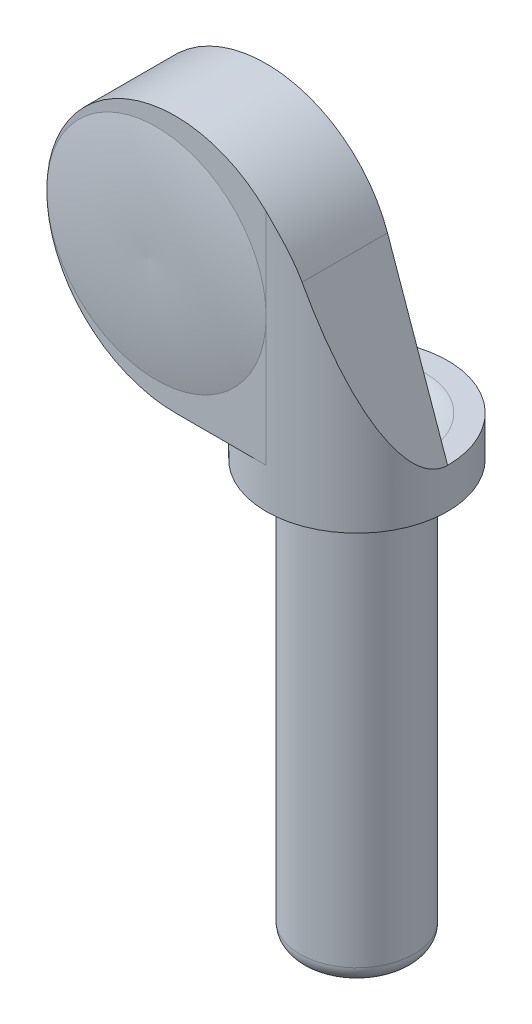
ISO-10303-21;
HEADER;
FILE_DESCRIPTION(('STEP AP214'),'2;1');
FILE_NAME('part.step','',(''),(''),'','','');
FILE_SCHEMA(('AUTOMOTIVE_DESIGN { 1 0 10303 214 1 1 1 1 }'));
ENDSEC;
DATA;
#1=APPLICATION_CONTEXT('core data for automotive mechanical design processes');
#2=APPLICATION_PROTOCOL_DEFINITION('international standard','automotive_design',2000,#1);
#3=PRODUCT_CONTEXT('',#1,'mechanical');
#4=PRODUCT('Part','Part','',(#3));
#5=PRODUCT_RELATED_PRODUCT_CATEGORY('part','',(#4));
#6=PRODUCT_DEFINITION_FORMATION('','',#4);
#7=PRODUCT_DEFINITION_CONTEXT('part definition',#1,'design');
#8=PRODUCT_DEFINITION('design','',#6,#7);
#9=PRODUCT_DEFINITION_SHAPE('','',#8);
#10=(LENGTH_UNIT() NAMED_UNIT(*) SI_UNIT(.MILLI.,.METRE.));
#11=(NAMED_UNIT(*) PLANE_ANGLE_UNIT() SI_UNIT($,.RADIAN.));
#12=(NAMED_UNIT(*) SI_UNIT($,.STERADIAN.) SOLID_ANGLE_UNIT());
#13=UNCERTAINTY_MEASURE_WITH_UNIT(LENGTH_MEASURE(1.E-05),#10,'distance_accuracy_value','');
#14=(GEOMETRIC_REPRESENTATION_CONTEXT(3) GLOBAL_UNCERTAINTY_ASSIGNED_CONTEXT((#13)) GLOBAL_UNIT_ASSIGNED_CONTEXT((#10,
#11,#12)) REPRESENTATION_CONTEXT('',''));
#15=CARTESIAN_POINT('',(0.,0.,0.));
#16=DIRECTION('',(0.,0.,1.));
#17=DIRECTION('',(1.,0.,0.));
#18=AXIS2_PLACEMENT_3D('',#15,#16,#17);
#19=CARTESIAN_POINT('',(-3.175,20.5,3.175));
#20=DIRECTION('',(0.,0.,1.));
#21=DIRECTION('',(1.,0.,0.));
#22=AXIS2_PLACEMENT_3D('',#19,#20,#21);
#23=PLANE('',#22);
#24=DIRECTION('',(0.,-1.,0.));
#25=VECTOR('',#24,1.);
#26=CARTESIAN_POINT('',(0.,25.,3.175));
#27=LINE('',#26,#25);
#28=CARTESIAN_POINT('',(0.,20.5000000000001,3.175));
#29=VERTEX_POINT('',#28);
#30=CARTESIAN_POINT('',(0.,16.,3.175));
#31=VERTEX_POINT('',#30);
#32=EDGE_CURVE('E163',#29,#31,#27,.T.);
#33=ORIENTED_EDGE('',*,*,#32,.F.);
#34=CARTESIAN_POINT('',(-3.8375,20.5,3.175));
#35=DIRECTION('',(0.,0.,-1.));
#36=DIRECTION('',(-1.,0.,0.));
#37=AXIS2_PLACEMENT_3D('',#34,#35,#36);
#38=CIRCLE('',#37,3.8375);
#39=CARTESIAN_POINT('',(-7.675,20.5,3.175));
#40=VERTEX_POINT('',#39);
#41=EDGE_CURVE('E127',#29,#40,#38,.T.);
#42=ORIENTED_EDGE('',*,*,#41,.T.);
#43=CARTESIAN_POINT('',(-3.175,20.5,3.175));
#44=DIRECTION('',(0.,0.,1.));
#45=DIRECTION('',(1.,0.,0.));
#46=AXIS2_PLACEMENT_3D('',#43,#44,#45);
#47=CIRCLE('',#46,4.5);
#48=CARTESIAN_POINT('',(-3.175,16.,3.175));
#49=VERTEX_POINT('',#48);
#50=EDGE_CURVE('E239',#40,#49,#47,.T.);
#51=ORIENTED_EDGE('',*,*,#50,.T.);
#52=DIRECTION('',(1.,0.,0.));
#53=VECTOR('',#52,1.);
#54=CARTESIAN_POINT('',(3.175,16.,3.175));
#55=LINE('',#54,#53);
#56=EDGE_CURVE('E226',#49,#31,#55,.T.);
#57=ORIENTED_EDGE('',*,*,#56,.T.);
#58=EDGE_LOOP('',(#33,#42,#51,#57));
#59=FACE_BOUND('',#58,.T.);
#60=ADVANCED_FACE('F39',(#59),#23,.T.);
#61=CARTESIAN_POINT('',(0.,23.6889457505577,3.175));
#62=VERTEX_POINT('',#61);
#63=EDGE_CURVE('E235',#62,#40,#47,.T.);
#64=ORIENTED_EDGE('',*,*,#63,.T.);
#65=EDGE_CURVE('E159',#40,#29,#38,.T.);
#66=ORIENTED_EDGE('',*,*,#65,.T.);
#67=EDGE_CURVE('E164',#62,#29,#27,.T.);
#68=ORIENTED_EDGE('',*,*,#67,.F.);
#69=EDGE_LOOP('',(#64,#66,#68));
#70=FACE_BOUND('',#69,.T.);
#71=ADVANCED_FACE('F206',(#70),#23,.T.);
#72=CARTESIAN_POINT('',(0.,16.,0.));
#73=DIRECTION('',(0.,-1.,0.));
#74=DIRECTION('',(0.,0.,-1.));
#75=AXIS2_PLACEMENT_3D('',#72,#73,#74);
#76=CYLINDRICAL_SURFACE('',#75,2.);
#77=CARTESIAN_POINT('',(0.,0.6,0.));
#78=DIRECTION('',(0.,1.,0.));
#79=DIRECTION('',(0.,0.,1.));
#80=AXIS2_PLACEMENT_3D('',#77,#78,#79);
#81=CIRCLE('',#80,2.);
#82=CARTESIAN_POINT('',(0.,0.6,2.));
#83=VERTEX_POINT('',#82);
#84=EDGE_CURVE('E132',#83,#83,#81,.T.);
#85=ORIENTED_EDGE('',*,*,#84,.T.);
#86=EDGE_LOOP('',(#85));
#87=FACE_BOUND('',#86,.T.);
#88=CARTESIAN_POINT('',(0.,14.6,0.));
#89=DIRECTION('',(0.,1.,0.));
#90=DIRECTION('',(0.,0.,1.));
#91=AXIS2_PLACEMENT_3D('',#88,#89,#90);
#92=CIRCLE('',#91,2.);
#93=CARTESIAN_POINT('',(0.,14.6,2.));
#94=VERTEX_POINT('',#93);
#95=EDGE_CURVE('E121',#94,#94,#92,.T.);
#96=ORIENTED_EDGE('',*,*,#95,.F.);
#97=EDGE_LOOP('',(#96));
#98=FACE_BOUND('',#97,.T.);
#99=ADVANCED_FACE('F208',(#87,#98),#76,.T.);
#100=CARTESIAN_POINT('',(0.,0.,0.));
#101=DIRECTION('',(0.,1.,0.));
#102=DIRECTION('',(0.,0.,1.));
#103=AXIS2_PLACEMENT_3D('',#100,#101,#102);
#104=PLANE('',#103);
#105=CARTESIAN_POINT('',(0.,0.,0.));
#106=DIRECTION('',(0.,1.,0.));
#107=DIRECTION('',(0.,0.,1.));
#108=AXIS2_PLACEMENT_3D('',#105,#106,#107);
#109=CIRCLE('',#108,1.4);
#110=CARTESIAN_POINT('',(1.4,0.,0.));
#111=VERTEX_POINT('',#110);
#112=CARTESIAN_POINT('',(-1.4,0.,0.));
#113=VERTEX_POINT('',#112);
#114=EDGE_CURVE('E122',#111,#113,#109,.F.);
#115=ORIENTED_EDGE('',*,*,#114,.T.);
#116=DIRECTION('',(-1.,0.,0.));
#117=VECTOR('',#116,1.);
#118=CARTESIAN_POINT('',(-1.4,0.,0.));
#119=LINE('',#118,#117);
#120=EDGE_CURVE('E105',#111,#113,#119,.T.);
#121=ORIENTED_EDGE('',*,*,#120,.F.);
#122=EDGE_LOOP('',(#115,#121));
#123=FACE_BOUND('',#122,.T.);
#124=ADVANCED_FACE('F125',(#123),#104,.F.);
#125=CARTESIAN_POINT('',(0.,0.6,0.));
#126=DIRECTION('',(0.,1.,0.));
#127=DIRECTION('',(0.,0.,1.));
#128=AXIS2_PLACEMENT_3D('',#125,#126,#127);
#129=TOROIDAL_SURFACE('',#128,1.4,0.6);
#130=EDGE_CURVE('E115',#113,#111,#109,.F.);
#131=ORIENTED_EDGE('',*,*,#130,.F.);
#132=ORIENTED_EDGE('',*,*,#114,.F.);
#133=EDGE_LOOP('',(#131,#132));
#134=FACE_BOUND('',#133,.T.);
#135=ORIENTED_EDGE('',*,*,#84,.F.);
#136=EDGE_LOOP('',(#135));
#137=FACE_BOUND('',#136,.T.);
#138=ADVANCED_FACE('F129',(#134,#137),#129,.T.);
#139=CARTESIAN_POINT('',(0.,14.6,0.));
#140=DIRECTION('',(0.,1.,0.));
#141=DIRECTION('',(0.,0.,1.));
#142=AXIS2_PLACEMENT_3D('',#139,#140,#141);
#143=CYLINDRICAL_SURFACE('',#142,3.175);
#144=CARTESIAN_POINT('',(0.,14.6,0.));
#145=DIRECTION('',(0.,1.,0.));
#146=DIRECTION('',(0.,0.,1.));
#147=AXIS2_PLACEMENT_3D('',#144,#145,#146);
#148=CIRCLE('',#147,3.175);
#149=CARTESIAN_POINT('',(0.,14.6,3.175));
#150=VERTEX_POINT('',#149);
#151=EDGE_CURVE('E273',#150,#150,#148,.T.);
#152=ORIENTED_EDGE('',*,*,#151,.T.);
#153=EDGE_LOOP('',(#152));
#154=FACE_BOUND('',#153,.T.);
#155=CARTESIAN_POINT('',(0.,16.,0.));
#156=DIRECTION('',(0.,1.,0.));
#157=DIRECTION('',(0.,0.,1.));
#158=AXIS2_PLACEMENT_3D('',#155,#156,#157);
#159=CIRCLE('',#158,3.175);
#160=CARTESIAN_POINT('',(3.175,16.,0.));
#161=VERTEX_POINT('',#160);
#162=CARTESIAN_POINT('',(-3.175,16.,0.));
#163=VERTEX_POINT('',#162);
#164=EDGE_CURVE('E266',#161,#163,#159,.T.);
#165=ORIENTED_EDGE('',*,*,#164,.F.);
#166=CARTESIAN_POINT('',(0.,25.0397932494707,0.));
#167=DIRECTION('',(-0.943497461719427,-0.331379751537414,0.));
#168=DIRECTION('',(0.331379751537414,-0.943497461719427,0.));
#169=AXIS2_PLACEMENT_3D('',#166,#167,#168);
#170=ELLIPSE('',#169,9.58115269647529,3.175);
#171=CARTESIAN_POINT('',(1.07073857773742,21.9912088819184,2.98900383039983));
#172=VERTEX_POINT('',#171);
#173=EDGE_CURVE('E178',#172,#161,#170,.F.);
#174=ORIENTED_EDGE('',*,*,#173,.F.);
#175=CARTESIAN_POINT('',(0.,23.6889457505577,3.175));
#176=CARTESIAN_POINT('',(0.0973365468710318,23.5920718778637,3.17498257572158));
#177=CARTESIAN_POINT('',(0.190105236123647,23.4908040103089,3.17052675896893));
#178=CARTESIAN_POINT('',(0.365761456412195,23.2805914301936,3.15509670358));
#179=CARTESIAN_POINT('',(0.448655992318863,23.171652248133,3.14412711937189));
#180=CARTESIAN_POINT('',(0.60239179368092,22.949333791305,3.1182846504052));
#181=CARTESIAN_POINT('',(0.673442597173547,22.8360885424587,3.10349503156049));
#182=CARTESIAN_POINT('',(0.80507986409488,22.6039830884985,3.07197833799164));
#183=CARTESIAN_POINT('',(0.865671145575849,22.4851255009467,3.05525216128354));
#184=CARTESIAN_POINT('',(0.948519359076545,22.3030671631603,3.03014363751049));
#185=CARTESIAN_POINT('',(0.974822142389804,22.241677074615,3.02176093190307));
#186=CARTESIAN_POINT('',(1.02480746821655,22.1174426696885,3.00517704794229));
#187=CARTESIAN_POINT('',(1.04847584077047,22.0545924984813,2.99697702475624));
#188=CARTESIAN_POINT('',(1.07073857773742,21.9912088819184,2.98900383039983));
#189=B_SPLINE_CURVE_WITH_KNOTS('',3,(#175,#176,#177,#178,#179,#180,#181,#182,#183,#184,#185,
#186,#187,#188),.UNSPECIFIED.,.F.,.F.,(4,2,2,2,2,2,4),(0.,0.411576384055855,0.822859028516628,
1.22583913711873,1.62863311957935,1.83051120234178,2.03342742820668),.UNSPECIFIED.);
#190=EDGE_CURVE('E168',#62,#172,#189,.T.);
#191=ORIENTED_EDGE('',*,*,#190,.F.);
#192=ORIENTED_EDGE('',*,*,#67,.T.);
#193=ORIENTED_EDGE('',*,*,#32,.T.);
#194=EDGE_CURVE('E271',#163,#31,#159,.T.);
#195=ORIENTED_EDGE('',*,*,#194,.F.);
#196=EDGE_LOOP('',(#165,#174,#191,#192,#193,#195));
#197=FACE_BOUND('',#196,.T.);
#198=ADVANCED_FACE('F193',(#154,#197),#143,.T.);
#199=CARTESIAN_POINT('',(0.,14.6,0.));
#200=DIRECTION('',(0.,1.,0.));
#201=DIRECTION('',(0.,0.,1.));
#202=AXIS2_PLACEMENT_3D('',#199,#200,#201);
#203=PLANE('',#202);
#204=ORIENTED_EDGE('',*,*,#95,.T.);
#205=EDGE_LOOP('',(#204));
#206=FACE_BOUND('',#205,.T.);
#207=ORIENTED_EDGE('',*,*,#151,.F.);
#208=EDGE_LOOP('',(#207));
#209=FACE_BOUND('',#208,.T.);
#210=ADVANCED_FACE('F189',(#206,#209),#203,.F.);
#211=CARTESIAN_POINT('',(-3.175,20.5,2.775));
#212=DIRECTION('',(0.,0.,-1.));
#213=DIRECTION('',(-1.,0.,0.));
#214=AXIS2_PLACEMENT_3D('',#211,#212,#213);
#215=PLANE('',#214);
#216=CARTESIAN_POINT('',(-3.175,20.5,2.775));
#217=DIRECTION('',(0.,0.,-1.));
#218=DIRECTION('',(-1.,0.,0.));
#219=AXIS2_PLACEMENT_3D('',#216,#217,#218);
#220=CIRCLE('',#219,3.15);
#221=CARTESIAN_POINT('',(-6.325,20.5,2.775));
#222=VERTEX_POINT('',#221);
#223=EDGE_CURVE('E256',#222,#222,#220,.T.);
#224=ORIENTED_EDGE('',*,*,#223,.T.);
#225=EDGE_LOOP('',(#224));
#226=FACE_BOUND('',#225,.T.);
#227=ADVANCED_FACE('F192',(#226),#215,.T.);
#228=CARTESIAN_POINT('',(3.175,16.,3.175));
#229=DIRECTION('',(-0.943497461719427,-0.331379751537414,0.));
#230=DIRECTION('',(0.331379751537414,-0.943497461719427,0.));
#231=AXIS2_PLACEMENT_3D('',#228,#229,#230);
#232=PLANE('',#231);
#233=DIRECTION('',(0.,0.,-1.));
#234=VECTOR('',#233,1.);
#235=CARTESIAN_POINT('',(1.07073857773742,21.9912088819184,3.175));
#236=LINE('',#235,#234);
#237=CARTESIAN_POINT('',(1.07073857773742,21.9912088819184,0.));
#238=VERTEX_POINT('',#237);
#239=EDGE_CURVE('E246',#172,#238,#236,.T.);
#240=ORIENTED_EDGE('',*,*,#239,.F.);
#241=ORIENTED_EDGE('',*,*,#173,.T.);
#242=DIRECTION('',(-0.331379751537414,0.943497461719427,0.));
#243=VECTOR('',#242,1.);
#244=CARTESIAN_POINT('',(3.175,16.,0.));
#245=LINE('',#244,#243);
#246=EDGE_CURVE('E251',#161,#238,#245,.T.);
#247=ORIENTED_EDGE('',*,*,#246,.T.);
#248=EDGE_LOOP('',(#240,#241,#247));
#249=FACE_BOUND('',#248,.T.);
#250=ADVANCED_FACE('F200',(#249),#232,.F.);
#251=CARTESIAN_POINT('',(3.175,16.,3.175));
#252=DIRECTION('',(0.,1.,0.));
#253=DIRECTION('',(0.,0.,1.));
#254=AXIS2_PLACEMENT_3D('',#251,#252,#253);
#255=PLANE('',#254);
#256=DIRECTION('',(0.,0.,-1.));
#257=VECTOR('',#256,1.);
#258=CARTESIAN_POINT('',(-3.175,16.,3.175));
#259=LINE('',#258,#257);
#260=EDGE_CURVE('E241',#49,#163,#259,.T.);
#261=ORIENTED_EDGE('',*,*,#260,.T.);
#262=ORIENTED_EDGE('',*,*,#194,.T.);
#263=ORIENTED_EDGE('',*,*,#56,.F.);
#264=EDGE_LOOP('',(#261,#262,#263));
#265=FACE_BOUND('',#264,.T.);
#266=ADVANCED_FACE('F284',(#265),#255,.F.);
#267=CARTESIAN_POINT('',(-3.175,20.5,3.175));
#268=DIRECTION('',(0.,0.,-1.));
#269=DIRECTION('',(-1.,0.,0.));
#270=AXIS2_PLACEMENT_3D('',#267,#268,#269);
#271=CYLINDRICAL_SURFACE('',#270,4.5);
#272=ORIENTED_EDGE('',*,*,#63,.F.);
#273=ORIENTED_EDGE('',*,*,#190,.T.);
#274=ORIENTED_EDGE('',*,*,#239,.T.);
#275=CARTESIAN_POINT('',(-3.175,20.5,0.));
#276=DIRECTION('',(0.,0.,1.));
#277=DIRECTION('',(1.,0.,0.));
#278=AXIS2_PLACEMENT_3D('',#275,#276,#277);
#279=CIRCLE('',#278,4.5);
#280=EDGE_CURVE('E255',#238,#163,#279,.T.);
#281=ORIENTED_EDGE('',*,*,#280,.T.);
#282=ORIENTED_EDGE('',*,*,#260,.F.);
#283=ORIENTED_EDGE('',*,*,#50,.F.);
#284=EDGE_LOOP('',(#272,#273,#274,#281,#282,#283));
#285=FACE_BOUND('',#284,.T.);
#286=ADVANCED_FACE('F180',(#285),#271,.T.);
#287=CARTESIAN_POINT('',(-3.175,20.5,2.775));
#288=DIRECTION('',(0.,0.,-1.));
#289=DIRECTION('',(-1.,0.,0.));
#290=AXIS2_PLACEMENT_3D('',#287,#288,#289);
#291=CYLINDRICAL_SURFACE('',#290,3.15);
#292=CARTESIAN_POINT('',(-3.175,20.5,0.3));
#293=DIRECTION('',(0.,0.,1.));
#294=DIRECTION('',(1.,0.,0.));
#295=AXIS2_PLACEMENT_3D('',#292,#293,#294);
#296=CIRCLE('',#295,3.15);
#297=CARTESIAN_POINT('',(-0.024999999999999,20.5,0.3));
#298=VERTEX_POINT('',#297);
#299=EDGE_CURVE('E142',#298,#298,#296,.F.);
#300=ORIENTED_EDGE('',*,*,#299,.T.);
#301=EDGE_LOOP('',(#300));
#302=FACE_BOUND('',#301,.T.);
#303=ORIENTED_EDGE('',*,*,#223,.F.);
#304=EDGE_LOOP('',(#303));
#305=FACE_BOUND('',#304,.T.);
#306=ADVANCED_FACE('F202',(#302,#305),#291,.F.);
#307=CARTESIAN_POINT('',(-3.175,20.5,0.));
#308=DIRECTION('',(0.,0.,1.));
#309=DIRECTION('',(1.,0.,0.));
#310=AXIS2_PLACEMENT_3D('',#307,#308,#309);
#311=PLANE('',#310);
#312=CARTESIAN_POINT('',(-3.175,20.5,0.));
#313=DIRECTION('',(0.,0.,1.));
#314=DIRECTION('',(1.,0.,0.));
#315=AXIS2_PLACEMENT_3D('',#312,#313,#314);
#316=CIRCLE('',#315,3.45);
#317=CARTESIAN_POINT('',(0.275000000000001,20.5,0.));
#318=VERTEX_POINT('',#317);
#319=EDGE_CURVE('E146',#318,#318,#316,.T.);
#320=ORIENTED_EDGE('',*,*,#319,.T.);
#321=EDGE_LOOP('',(#320));
#322=FACE_BOUND('',#321,.T.);
#323=DIRECTION('',(1.,0.,0.));
#324=VECTOR('',#323,1.);
#325=CARTESIAN_POINT('',(0.,16.,0.));
#326=LINE('',#325,#324);
#327=CARTESIAN_POINT('',(-2.4,16.,0.));
#328=VERTEX_POINT('',#327);
#329=EDGE_CURVE('E135',#163,#328,#326,.T.);
#330=ORIENTED_EDGE('',*,*,#329,.F.);
#331=ORIENTED_EDGE('',*,*,#280,.F.);
#332=ORIENTED_EDGE('',*,*,#246,.F.);
#333=CARTESIAN_POINT('',(2.4,16.,0.));
#334=VERTEX_POINT('',#333);
#335=EDGE_CURVE('E261',#334,#161,#326,.T.);
#336=ORIENTED_EDGE('',*,*,#335,.F.);
#337=CARTESIAN_POINT('',(2.4,15.,0.));
#338=DIRECTION('',(0.,0.,1.));
#339=DIRECTION('',(1.,0.,0.));
#340=AXIS2_PLACEMENT_3D('',#337,#338,#339);
#341=CIRCLE('',#340,1.);
#342=CARTESIAN_POINT('',(1.4,15.,0.));
#343=VERTEX_POINT('',#342);
#344=EDGE_CURVE('E11',#334,#343,#341,.T.);
#345=ORIENTED_EDGE('',*,*,#344,.T.);
#346=DIRECTION('',(0.,1.,0.));
#347=VECTOR('',#346,1.);
#348=CARTESIAN_POINT('',(1.4,-0.001000000000001,0.));
#349=LINE('',#348,#347);
#350=EDGE_CURVE('E101',#111,#343,#349,.T.);
#351=ORIENTED_EDGE('',*,*,#350,.F.);
#352=ORIENTED_EDGE('',*,*,#120,.T.);
#353=DIRECTION('',(0.,1.,0.));
#354=VECTOR('',#353,1.);
#355=CARTESIAN_POINT('',(-1.4,-0.001000000000001,0.));
#356=LINE('',#355,#354);
#357=CARTESIAN_POINT('',(-1.4,15.,0.));
#358=VERTEX_POINT('',#357);
#359=EDGE_CURVE('E112',#113,#358,#356,.T.);
#360=ORIENTED_EDGE('',*,*,#359,.T.);
#361=CARTESIAN_POINT('',(-2.4,15.,0.));
#362=DIRECTION('',(0.,0.,1.));
#363=DIRECTION('',(1.,0.,0.));
#364=AXIS2_PLACEMENT_3D('',#361,#362,#363);
#365=CIRCLE('',#364,1.);
#366=EDGE_CURVE('E48',#358,#328,#365,.T.);
#367=ORIENTED_EDGE('',*,*,#366,.T.);
#368=EDGE_LOOP('',(#330,#331,#332,#336,#345,#351,#352,#360,#367));
#369=FACE_BOUND('',#368,.T.);
#370=ADVANCED_FACE('F103',(#322,#369),#311,.F.);
#371=CARTESIAN_POINT('',(0.,16.,0.));
#372=DIRECTION('',(0.,1.,0.));
#373=DIRECTION('',(0.,0.,1.));
#374=AXIS2_PLACEMENT_3D('',#371,#372,#373);
#375=PLANE('',#374);
#376=ORIENTED_EDGE('',*,*,#329,.T.);
#377=CARTESIAN_POINT('',(0.,16.,0.));
#378=DIRECTION('',(0.,1.,0.));
#379=DIRECTION('',(0.,0.,1.));
#380=AXIS2_PLACEMENT_3D('',#377,#378,#379);
#381=CIRCLE('',#380,2.4);
#382=EDGE_CURVE('E61',#328,#334,#381,.F.);
#383=ORIENTED_EDGE('',*,*,#382,.T.);
#384=ORIENTED_EDGE('',*,*,#335,.T.);
#385=ORIENTED_EDGE('',*,*,#164,.T.);
#386=EDGE_LOOP('',(#376,#383,#384,#385));
#387=FACE_BOUND('',#386,.T.);
#388=ADVANCED_FACE('F211',(#387),#375,.T.);
#389=CARTESIAN_POINT('',(-4.53058163476535,20.5,-12.3533411719599));
#390=DIRECTION('',(0.,-1.,0.));
#391=DIRECTION('',(-1.,0.,0.));
#392=AXIS2_PLACEMENT_3D('',#389,#390,#391);
#393=CIRCLE('',#392,15.8435080209027);
#394=TRIMMED_CURVE('',#393,(PARAMETER_VALUE(-1.61455575676841)),
(PARAMETER_VALUE(1.61455575676841)),.T.,.PARAMETER.);
#395=CARTESIAN_POINT('',(-3.8375,20.5,-12.3533411719599));
#396=DIRECTION('',(0.,0.,-1.));
#397=AXIS1_PLACEMENT('',#395,#396);
#398=SURFACE_OF_REVOLUTION('',#394,#397);
#399=ORIENTED_EDGE('',*,*,#65,.F.);
#400=ORIENTED_EDGE('',*,*,#41,.F.);
#401=EDGE_LOOP('',(#399,#400));
#402=FACE_BOUND('',#401,.T.);
#403=CARTESIAN_POINT('',(-3.8375,20.5,3.475));
#404=VERTEX_POINT('',#403);
#405=VERTEX_LOOP('',#404);
#406=FACE_BOUND('',#405,.T.);
#407=ADVANCED_FACE('F187',(#402,#406),#398,.T.);
#408=CARTESIAN_POINT('',(-3.175,20.5,0.3));
#409=DIRECTION('',(0.,0.,1.));
#410=DIRECTION('',(1.,0.,0.));
#411=AXIS2_PLACEMENT_3D('',#408,#409,#410);
#412=TOROIDAL_SURFACE('',#411,3.45,0.3);
#413=ORIENTED_EDGE('',*,*,#319,.F.);
#414=EDGE_LOOP('',(#413));
#415=FACE_BOUND('',#414,.T.);
#416=ORIENTED_EDGE('',*,*,#299,.F.);
#417=EDGE_LOOP('',(#416));
#418=FACE_BOUND('',#417,.T.);
#419=ADVANCED_FACE('F298',(#415,#418),#412,.T.);
#420=CARTESIAN_POINT('',(0.,-0.001000000000001,0.));
#421=DIRECTION('',(0.,1.,0.));
#422=DIRECTION('',(0.,0.,1.));
#423=AXIS2_PLACEMENT_3D('',#420,#421,#422);
#424=CYLINDRICAL_SURFACE('',#423,1.4);
#425=ORIENTED_EDGE('',*,*,#350,.T.);
#426=CARTESIAN_POINT('',(0.,15.,0.));
#427=DIRECTION('',(0.,1.,0.));
#428=DIRECTION('',(0.,0.,1.));
#429=AXIS2_PLACEMENT_3D('',#426,#427,#428);
#430=CIRCLE('',#429,1.4);
#431=EDGE_CURVE('E150',#343,#358,#430,.T.);
#432=ORIENTED_EDGE('',*,*,#431,.T.);
#433=ORIENTED_EDGE('',*,*,#359,.F.);
#434=ORIENTED_EDGE('',*,*,#130,.T.);
#435=EDGE_LOOP('',(#425,#432,#433,#434));
#436=FACE_BOUND('',#435,.T.);
#437=ADVANCED_FACE('F116',(#436),#424,.F.);
#438=CARTESIAN_POINT('',(0.,15.,0.));
#439=DIRECTION('',(0.,1.,0.));
#440=DIRECTION('',(0.,0.,1.));
#441=AXIS2_PLACEMENT_3D('',#438,#439,#440);
#442=TOROIDAL_SURFACE('',#441,2.4,1.);
#443=ORIENTED_EDGE('',*,*,#344,.F.);
#444=ORIENTED_EDGE('',*,*,#382,.F.);
#445=ORIENTED_EDGE('',*,*,#366,.F.);
#446=ORIENTED_EDGE('',*,*,#431,.F.);
#447=EDGE_LOOP('',(#443,#444,#445,#446));
#448=FACE_BOUND('',#447,.T.);
#449=ADVANCED_FACE('F41',(#448),#442,.T.);
#450=CLOSED_SHELL('',(#60,#71,#99,#124,#138,#198,#210,#227,#250,#266,#286,#306,#370,#388,#407,
#419,#437,#449));
#451=MANIFOLD_SOLID_BREP('B2',#450);
#452=ADVANCED_BREP_SHAPE_REPRESENTATION('',(#18,#451),#14);
#453=SHAPE_DEFINITION_REPRESENTATION(#9,#452);
ENDSEC;
END-ISO-10303-21;
